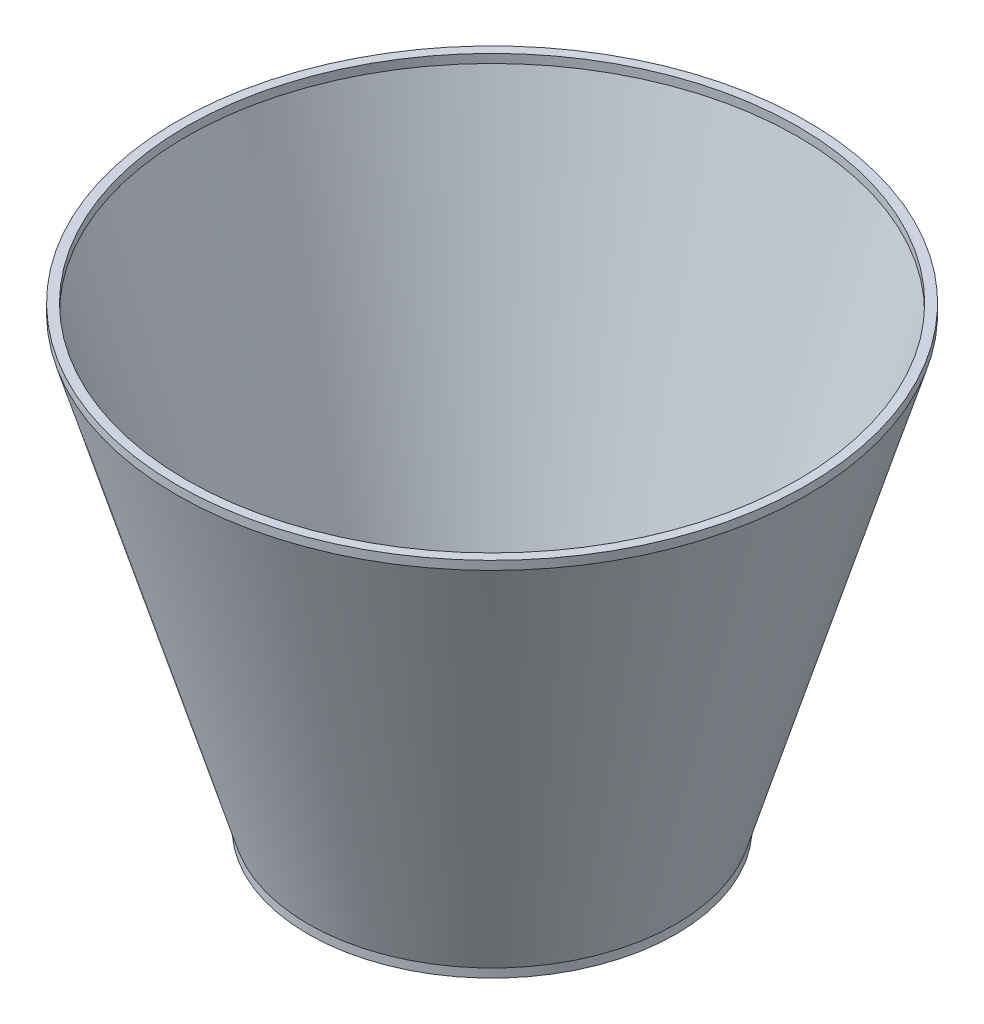
ISO-10303-21;
HEADER;
FILE_DESCRIPTION(('STEP AP214'),'2;1');
FILE_NAME('part.step','',(''),(''),'','','');
FILE_SCHEMA(('AUTOMOTIVE_DESIGN { 1 0 10303 214 1 1 1 1 }'));
ENDSEC;
DATA;
#1=APPLICATION_CONTEXT('core data for automotive mechanical design processes');
#2=APPLICATION_PROTOCOL_DEFINITION('international standard','automotive_design',2000,#1);
#3=PRODUCT_CONTEXT('',#1,'mechanical');
#4=PRODUCT('Part','Part','',(#3));
#5=PRODUCT_RELATED_PRODUCT_CATEGORY('part','',(#4));
#6=PRODUCT_DEFINITION_FORMATION('','',#4);
#7=PRODUCT_DEFINITION_CONTEXT('part definition',#1,'design');
#8=PRODUCT_DEFINITION('design','',#6,#7);
#9=PRODUCT_DEFINITION_SHAPE('','',#8);
#10=(LENGTH_UNIT() NAMED_UNIT(*) SI_UNIT(.MILLI.,.METRE.));
#11=(NAMED_UNIT(*) PLANE_ANGLE_UNIT() SI_UNIT($,.RADIAN.));
#12=(NAMED_UNIT(*) SI_UNIT($,.STERADIAN.) SOLID_ANGLE_UNIT());
#13=UNCERTAINTY_MEASURE_WITH_UNIT(LENGTH_MEASURE(1.E-05),#10,'distance_accuracy_value','');
#14=(GEOMETRIC_REPRESENTATION_CONTEXT(3) GLOBAL_UNCERTAINTY_ASSIGNED_CONTEXT((#13)) GLOBAL_UNIT_ASSIGNED_CONTEXT((#10,
#11,#12)) REPRESENTATION_CONTEXT('',''));
#15=CARTESIAN_POINT('',(0.,0.,0.));
#16=DIRECTION('',(0.,0.,1.));
#17=DIRECTION('',(1.,0.,0.));
#18=AXIS2_PLACEMENT_3D('',#15,#16,#17);
#19=CARTESIAN_POINT('',(0.,100.,0.));
#20=DIRECTION('',(0.,1.,0.));
#21=DIRECTION('',(0.,0.,1.));
#22=AXIS2_PLACEMENT_3D('',#19,#20,#21);
#23=CONICAL_SURFACE('',#22,72.0880613017821,0.291456794477867);
#24=CARTESIAN_POINT('',(0.,0.,0.));
#25=DIRECTION('',(0.,-1.,0.));
#26=DIRECTION('',(0.,0.,-1.));
#27=AXIS2_PLACEMENT_3D('',#24,#25,#26);
#28=CIRCLE('',#27,42.0880613017821);
#29=CARTESIAN_POINT('',(0.,0.,-42.0880613017821));
#30=VERTEX_POINT('',#29);
#31=EDGE_CURVE('E10',#30,#30,#28,.T.);
#32=ORIENTED_EDGE('',*,*,#31,.F.);
#33=EDGE_LOOP('',(#32));
#34=FACE_BOUND('',#33,.T.);
#35=CARTESIAN_POINT('',(0.,100.,0.));
#36=DIRECTION('',(0.,1.,0.));
#37=DIRECTION('',(0.,0.,1.));
#38=AXIS2_PLACEMENT_3D('',#35,#36,#37);
#39=CIRCLE('',#38,72.0880613017821);
#40=CARTESIAN_POINT('',(0.,100.,72.0880613017821));
#41=VERTEX_POINT('',#40);
#42=EDGE_CURVE('E71',#41,#41,#39,.T.);
#43=ORIENTED_EDGE('',*,*,#42,.F.);
#44=EDGE_LOOP('',(#43));
#45=FACE_BOUND('',#44,.T.);
#46=ADVANCED_FACE('F43',(#34,#45),#23,.T.);
#47=CARTESIAN_POINT('',(0.,0.,0.));
#48=DIRECTION('',(0.,1.,0.));
#49=DIRECTION('',(0.,0.,1.));
#50=AXIS2_PLACEMENT_3D('',#47,#48,#49);
#51=CONICAL_SURFACE('',#50,40.,0.291456794477867);
#52=CARTESIAN_POINT('',(0.,100.,0.));
#53=DIRECTION('',(0.,-1.,0.));
#54=DIRECTION('',(0.,0.,-1.));
#55=AXIS2_PLACEMENT_3D('',#52,#53,#54);
#56=CIRCLE('',#55,70.);
#57=CARTESIAN_POINT('',(0.,100.,-70.));
#58=VERTEX_POINT('',#57);
#59=EDGE_CURVE('E50',#58,#58,#56,.T.);
#60=ORIENTED_EDGE('',*,*,#59,.F.);
#61=EDGE_LOOP('',(#60));
#62=FACE_BOUND('',#61,.T.);
#63=CARTESIAN_POINT('',(0.,0.,0.));
#64=DIRECTION('',(0.,-1.,0.));
#65=DIRECTION('',(0.,0.,-1.));
#66=AXIS2_PLACEMENT_3D('',#63,#64,#65);
#67=CIRCLE('',#66,40.);
#68=CARTESIAN_POINT('',(0.,0.,-40.));
#69=VERTEX_POINT('',#68);
#70=EDGE_CURVE('E63',#69,#69,#67,.T.);
#71=ORIENTED_EDGE('',*,*,#70,.T.);
#72=EDGE_LOOP('',(#71));
#73=FACE_BOUND('',#72,.T.);
#74=ADVANCED_FACE('F102',(#62,#73),#51,.F.);
#75=CARTESIAN_POINT('',(0.,-2.,0.));
#76=DIRECTION('',(0.,-1.,0.));
#77=DIRECTION('',(0.,0.,-1.));
#78=AXIS2_PLACEMENT_3D('',#75,#76,#77);
#79=PLANE('',#78);
#80=CARTESIAN_POINT('',(0.,-2.,0.));
#81=DIRECTION('',(0.,-1.,0.));
#82=DIRECTION('',(0.,0.,-1.));
#83=AXIS2_PLACEMENT_3D('',#80,#81,#82);
#84=CIRCLE('',#83,42.0880613017821);
#85=CARTESIAN_POINT('',(0.,-2.,-42.0880613017821));
#86=VERTEX_POINT('',#85);
#87=EDGE_CURVE('E55',#86,#86,#84,.T.);
#88=ORIENTED_EDGE('',*,*,#87,.T.);
#89=EDGE_LOOP('',(#88));
#90=FACE_BOUND('',#89,.T.);
#91=CARTESIAN_POINT('',(0.,-2.,0.));
#92=DIRECTION('',(0.,-1.,0.));
#93=DIRECTION('',(0.,0.,-1.));
#94=AXIS2_PLACEMENT_3D('',#91,#92,#93);
#95=CIRCLE('',#94,40.);
#96=CARTESIAN_POINT('',(0.,-2.,-40.));
#97=VERTEX_POINT('',#96);
#98=EDGE_CURVE('E60',#97,#97,#95,.T.);
#99=ORIENTED_EDGE('',*,*,#98,.F.);
#100=EDGE_LOOP('',(#99));
#101=FACE_BOUND('',#100,.T.);
#102=ADVANCED_FACE('F107',(#90,#101),#79,.T.);
#103=CARTESIAN_POINT('',(0.,-2.,0.));
#104=DIRECTION('',(0.,1.,0.));
#105=DIRECTION('',(0.,0.,1.));
#106=AXIS2_PLACEMENT_3D('',#103,#104,#105);
#107=CYLINDRICAL_SURFACE('',#106,42.0880613017821);
#108=ORIENTED_EDGE('',*,*,#87,.F.);
#109=EDGE_LOOP('',(#108));
#110=FACE_BOUND('',#109,.T.);
#111=ORIENTED_EDGE('',*,*,#31,.T.);
#112=EDGE_LOOP('',(#111));
#113=FACE_BOUND('',#112,.T.);
#114=ADVANCED_FACE('F97',(#110,#113),#107,.T.);
#115=CARTESIAN_POINT('',(0.,-2.,0.));
#116=DIRECTION('',(0.,1.,0.));
#117=DIRECTION('',(0.,0.,1.));
#118=AXIS2_PLACEMENT_3D('',#115,#116,#117);
#119=CYLINDRICAL_SURFACE('',#118,40.);
#120=ORIENTED_EDGE('',*,*,#98,.T.);
#121=EDGE_LOOP('',(#120));
#122=FACE_BOUND('',#121,.T.);
#123=ORIENTED_EDGE('',*,*,#70,.F.);
#124=EDGE_LOOP('',(#123));
#125=FACE_BOUND('',#124,.T.);
#126=ADVANCED_FACE('F88',(#122,#125),#119,.F.);
#127=CARTESIAN_POINT('',(0.,102.,0.));
#128=DIRECTION('',(0.,1.,0.));
#129=DIRECTION('',(0.,0.,1.));
#130=AXIS2_PLACEMENT_3D('',#127,#128,#129);
#131=PLANE('',#130);
#132=CARTESIAN_POINT('',(0.,102.,0.));
#133=DIRECTION('',(0.,1.,0.));
#134=DIRECTION('',(0.,0.,1.));
#135=AXIS2_PLACEMENT_3D('',#132,#133,#134);
#136=CIRCLE('',#135,72.0880613017821);
#137=CARTESIAN_POINT('',(0.,102.,72.0880613017821));
#138=VERTEX_POINT('',#137);
#139=EDGE_CURVE('E67',#138,#138,#136,.T.);
#140=ORIENTED_EDGE('',*,*,#139,.T.);
#141=EDGE_LOOP('',(#140));
#142=FACE_BOUND('',#141,.T.);
#143=CARTESIAN_POINT('',(0.,102.,0.));
#144=DIRECTION('',(0.,1.,0.));
#145=DIRECTION('',(0.,0.,1.));
#146=AXIS2_PLACEMENT_3D('',#143,#144,#145);
#147=CIRCLE('',#146,70.);
#148=CARTESIAN_POINT('',(0.,102.,70.));
#149=VERTEX_POINT('',#148);
#150=EDGE_CURVE('E75',#149,#149,#147,.T.);
#151=ORIENTED_EDGE('',*,*,#150,.F.);
#152=EDGE_LOOP('',(#151));
#153=FACE_BOUND('',#152,.T.);
#154=ADVANCED_FACE('F85',(#142,#153),#131,.T.);
#155=CARTESIAN_POINT('',(0.,102.,0.));
#156=DIRECTION('',(0.,-1.,0.));
#157=DIRECTION('',(0.,0.,-1.));
#158=AXIS2_PLACEMENT_3D('',#155,#156,#157);
#159=CYLINDRICAL_SURFACE('',#158,72.0880613017821);
#160=ORIENTED_EDGE('',*,*,#139,.F.);
#161=EDGE_LOOP('',(#160));
#162=FACE_BOUND('',#161,.T.);
#163=ORIENTED_EDGE('',*,*,#42,.T.);
#164=EDGE_LOOP('',(#163));
#165=FACE_BOUND('',#164,.T.);
#166=ADVANCED_FACE('F87',(#162,#165),#159,.T.);
#167=CARTESIAN_POINT('',(0.,102.,0.));
#168=DIRECTION('',(0.,-1.,0.));
#169=DIRECTION('',(0.,0.,-1.));
#170=AXIS2_PLACEMENT_3D('',#167,#168,#169);
#171=CYLINDRICAL_SURFACE('',#170,70.);
#172=ORIENTED_EDGE('',*,*,#150,.T.);
#173=EDGE_LOOP('',(#172));
#174=FACE_BOUND('',#173,.T.);
#175=ORIENTED_EDGE('',*,*,#59,.T.);
#176=EDGE_LOOP('',(#175));
#177=FACE_BOUND('',#176,.T.);
#178=ADVANCED_FACE('F83',(#174,#177),#171,.F.);
#179=CLOSED_SHELL('',(#46,#74,#102,#114,#126,#154,#166,#178));
#180=MANIFOLD_SOLID_BREP('B2',#179);
#181=ADVANCED_BREP_SHAPE_REPRESENTATION('',(#18,#180),#14);
#182=SHAPE_DEFINITION_REPRESENTATION(#9,#181);
ENDSEC;
END-ISO-10303-21;
